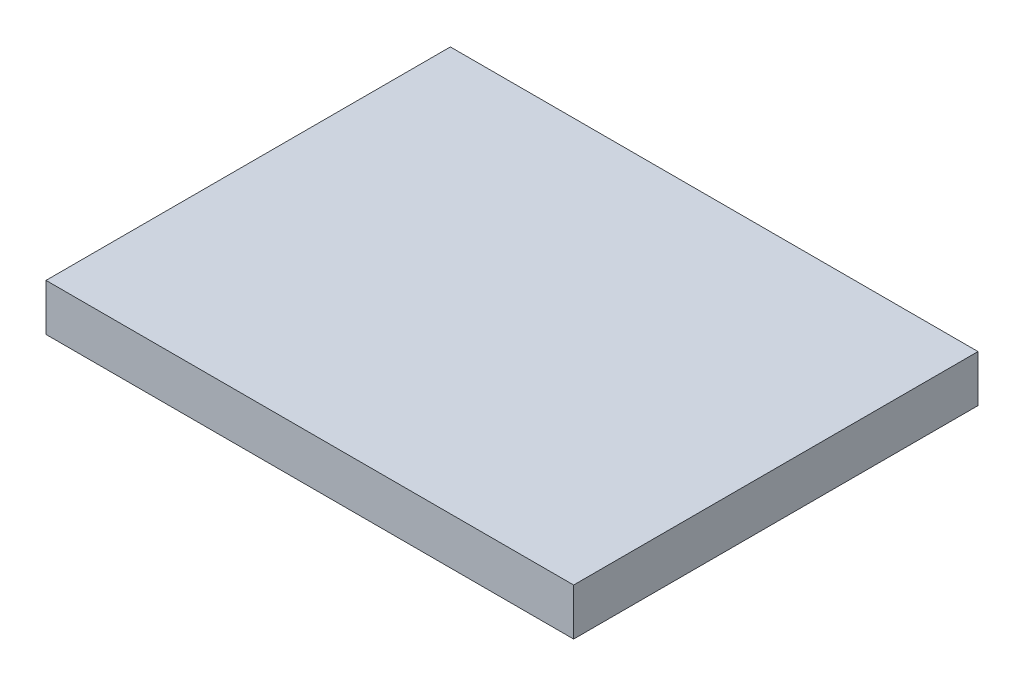
ISO-10303-21;
HEADER;
FILE_DESCRIPTION(('STEP AP214'),'2;1');
FILE_NAME('part.step','',(''),(''),'','','');
FILE_SCHEMA(('AUTOMOTIVE_DESIGN { 1 0 10303 214 1 1 1 1 }'));
ENDSEC;
DATA;
#1=APPLICATION_CONTEXT('core data for automotive mechanical design processes');
#2=APPLICATION_PROTOCOL_DEFINITION('international standard','automotive_design',2000,#1);
#3=PRODUCT_CONTEXT('',#1,'mechanical');
#4=PRODUCT('Part','Part','',(#3));
#5=PRODUCT_RELATED_PRODUCT_CATEGORY('part','',(#4));
#6=PRODUCT_DEFINITION_FORMATION('','',#4);
#7=PRODUCT_DEFINITION_CONTEXT('part definition',#1,'design');
#8=PRODUCT_DEFINITION('design','',#6,#7);
#9=PRODUCT_DEFINITION_SHAPE('','',#8);
#10=(LENGTH_UNIT() NAMED_UNIT(*) SI_UNIT(.MILLI.,.METRE.));
#11=(NAMED_UNIT(*) PLANE_ANGLE_UNIT() SI_UNIT($,.RADIAN.));
#12=(NAMED_UNIT(*) SI_UNIT($,.STERADIAN.) SOLID_ANGLE_UNIT());
#13=UNCERTAINTY_MEASURE_WITH_UNIT(LENGTH_MEASURE(1.E-05),#10,'distance_accuracy_value','');
#14=(GEOMETRIC_REPRESENTATION_CONTEXT(3) GLOBAL_UNCERTAINTY_ASSIGNED_CONTEXT((#13)) GLOBAL_UNIT_ASSIGNED_CONTEXT((#10,
#11,#12)) REPRESENTATION_CONTEXT('',''));
#15=CARTESIAN_POINT('',(0.,0.,0.));
#16=DIRECTION('',(0.,0.,1.));
#17=DIRECTION('',(1.,0.,0.));
#18=AXIS2_PLACEMENT_3D('',#15,#16,#17);
#19=CARTESIAN_POINT('',(-53.5,9.5,-41.));
#20=DIRECTION('',(1.,0.,0.));
#21=DIRECTION('',(0.,0.,-1.));
#22=AXIS2_PLACEMENT_3D('',#19,#20,#21);
#23=PLANE('',#22);
#24=DIRECTION('',(0.,0.,1.));
#25=VECTOR('',#24,1.);
#26=CARTESIAN_POINT('',(-53.5,0.,-41.));
#27=LINE('',#26,#25);
#28=CARTESIAN_POINT('',(-53.5,0.,-41.));
#29=VERTEX_POINT('',#28);
#30=CARTESIAN_POINT('',(-53.5,0.,41.));
#31=VERTEX_POINT('',#30);
#32=EDGE_CURVE('E96',#29,#31,#27,.T.);
#33=ORIENTED_EDGE('',*,*,#32,.T.);
#34=DIRECTION('',(0.,-1.,0.));
#35=VECTOR('',#34,1.);
#36=CARTESIAN_POINT('',(-53.5,9.5,41.));
#37=LINE('',#36,#35);
#38=CARTESIAN_POINT('',(-53.5,9.5,41.));
#39=VERTEX_POINT('',#38);
#40=EDGE_CURVE('E11',#39,#31,#37,.T.);
#41=ORIENTED_EDGE('',*,*,#40,.F.);
#42=DIRECTION('',(0.,0.,1.));
#43=VECTOR('',#42,1.);
#44=CARTESIAN_POINT('',(-53.5,9.5,-41.));
#45=LINE('',#44,#43);
#46=CARTESIAN_POINT('',(-53.5,9.5,-41.));
#47=VERTEX_POINT('',#46);
#48=EDGE_CURVE('E84',#47,#39,#45,.T.);
#49=ORIENTED_EDGE('',*,*,#48,.F.);
#50=DIRECTION('',(0.,-1.,0.));
#51=VECTOR('',#50,1.);
#52=CARTESIAN_POINT('',(-53.5,9.5,-41.));
#53=LINE('',#52,#51);
#54=EDGE_CURVE('E92',#47,#29,#53,.T.);
#55=ORIENTED_EDGE('',*,*,#54,.T.);
#56=EDGE_LOOP('',(#33,#41,#49,#55));
#57=FACE_BOUND('',#56,.T.);
#58=ADVANCED_FACE('F33',(#57),#23,.F.);
#59=CARTESIAN_POINT('',(53.5,9.5,41.));
#60=DIRECTION('',(0.,0.,-1.));
#61=DIRECTION('',(-1.,0.,0.));
#62=AXIS2_PLACEMENT_3D('',#59,#60,#61);
#63=PLANE('',#62);
#64=DIRECTION('',(1.,0.,0.));
#65=VECTOR('',#64,1.);
#66=CARTESIAN_POINT('',(53.5,0.,41.));
#67=LINE('',#66,#65);
#68=CARTESIAN_POINT('',(53.5,0.,41.));
#69=VERTEX_POINT('',#68);
#70=EDGE_CURVE('E88',#31,#69,#67,.T.);
#71=ORIENTED_EDGE('',*,*,#70,.T.);
#72=DIRECTION('',(0.,-1.,0.));
#73=VECTOR('',#72,1.);
#74=CARTESIAN_POINT('',(53.5,9.5,41.));
#75=LINE('',#74,#73);
#76=CARTESIAN_POINT('',(53.5,9.5,41.));
#77=VERTEX_POINT('',#76);
#78=EDGE_CURVE('E41',#77,#69,#75,.T.);
#79=ORIENTED_EDGE('',*,*,#78,.F.);
#80=DIRECTION('',(1.,0.,0.));
#81=VECTOR('',#80,1.);
#82=CARTESIAN_POINT('',(53.5,9.5,41.));
#83=LINE('',#82,#81);
#84=EDGE_CURVE('E79',#39,#77,#83,.T.);
#85=ORIENTED_EDGE('',*,*,#84,.F.);
#86=ORIENTED_EDGE('',*,*,#40,.T.);
#87=EDGE_LOOP('',(#71,#79,#85,#86));
#88=FACE_BOUND('',#87,.T.);
#89=ADVANCED_FACE('F87',(#88),#63,.F.);
#90=CARTESIAN_POINT('',(53.5,9.5,-41.));
#91=DIRECTION('',(-1.,0.,0.));
#92=DIRECTION('',(0.,0.,1.));
#93=AXIS2_PLACEMENT_3D('',#90,#91,#92);
#94=PLANE('',#93);
#95=DIRECTION('',(0.,0.,-1.));
#96=VECTOR('',#95,1.);
#97=CARTESIAN_POINT('',(53.5,0.,-41.));
#98=LINE('',#97,#96);
#99=CARTESIAN_POINT('',(53.5,0.,-41.));
#100=VERTEX_POINT('',#99);
#101=EDGE_CURVE('E66',#69,#100,#98,.T.);
#102=ORIENTED_EDGE('',*,*,#101,.T.);
#103=DIRECTION('',(0.,-1.,0.));
#104=VECTOR('',#103,1.);
#105=CARTESIAN_POINT('',(53.5,9.5,-41.));
#106=LINE('',#105,#104);
#107=CARTESIAN_POINT('',(53.5,9.5,-41.));
#108=VERTEX_POINT('',#107);
#109=EDGE_CURVE('E89',#108,#100,#106,.T.);
#110=ORIENTED_EDGE('',*,*,#109,.F.);
#111=DIRECTION('',(0.,0.,-1.));
#112=VECTOR('',#111,1.);
#113=CARTESIAN_POINT('',(53.5,9.5,-41.));
#114=LINE('',#113,#112);
#115=EDGE_CURVE('E82',#77,#108,#114,.T.);
#116=ORIENTED_EDGE('',*,*,#115,.F.);
#117=ORIENTED_EDGE('',*,*,#78,.T.);
#118=EDGE_LOOP('',(#102,#110,#116,#117));
#119=FACE_BOUND('',#118,.T.);
#120=ADVANCED_FACE('F90',(#119),#94,.F.);
#121=CARTESIAN_POINT('',(53.5,9.5,-41.));
#122=DIRECTION('',(0.,0.,1.));
#123=DIRECTION('',(1.,0.,0.));
#124=AXIS2_PLACEMENT_3D('',#121,#122,#123);
#125=PLANE('',#124);
#126=DIRECTION('',(-1.,0.,0.));
#127=VECTOR('',#126,1.);
#128=CARTESIAN_POINT('',(53.5,0.,-41.));
#129=LINE('',#128,#127);
#130=EDGE_CURVE('E72',#100,#29,#129,.T.);
#131=ORIENTED_EDGE('',*,*,#130,.T.);
#132=ORIENTED_EDGE('',*,*,#54,.F.);
#133=DIRECTION('',(-1.,0.,0.));
#134=VECTOR('',#133,1.);
#135=CARTESIAN_POINT('',(53.5,9.5,-41.));
#136=LINE('',#135,#134);
#137=EDGE_CURVE('E49',#108,#47,#136,.T.);
#138=ORIENTED_EDGE('',*,*,#137,.F.);
#139=ORIENTED_EDGE('',*,*,#109,.T.);
#140=EDGE_LOOP('',(#131,#132,#138,#139));
#141=FACE_BOUND('',#140,.T.);
#142=ADVANCED_FACE('F103',(#141),#125,.F.);
#143=CARTESIAN_POINT('',(0.,9.5,0.));
#144=DIRECTION('',(0.,-1.,0.));
#145=DIRECTION('',(0.,0.,-1.));
#146=AXIS2_PLACEMENT_3D('',#143,#144,#145);
#147=PLANE('',#146);
#148=ORIENTED_EDGE('',*,*,#48,.T.);
#149=ORIENTED_EDGE('',*,*,#84,.T.);
#150=ORIENTED_EDGE('',*,*,#115,.T.);
#151=ORIENTED_EDGE('',*,*,#137,.T.);
#152=EDGE_LOOP('',(#148,#149,#150,#151));
#153=FACE_BOUND('',#152,.T.);
#154=ADVANCED_FACE('F80',(#153),#147,.F.);
#155=CARTESIAN_POINT('',(0.,0.,0.));
#156=DIRECTION('',(0.,-1.,0.));
#157=DIRECTION('',(0.,0.,-1.));
#158=AXIS2_PLACEMENT_3D('',#155,#156,#157);
#159=PLANE('',#158);
#160=ORIENTED_EDGE('',*,*,#32,.F.);
#161=ORIENTED_EDGE('',*,*,#130,.F.);
#162=ORIENTED_EDGE('',*,*,#101,.F.);
#163=ORIENTED_EDGE('',*,*,#70,.F.);
#164=EDGE_LOOP('',(#160,#161,#162,#163));
#165=FACE_BOUND('',#164,.T.);
#166=ADVANCED_FACE('F106',(#165),#159,.T.);
#167=CLOSED_SHELL('',(#58,#89,#120,#142,#154,#166));
#168=MANIFOLD_SOLID_BREP('B2',#167);
#169=ADVANCED_BREP_SHAPE_REPRESENTATION('',(#18,#168),#14);
#170=SHAPE_DEFINITION_REPRESENTATION(#9,#169);
ENDSEC;
END-ISO-10303-21;
